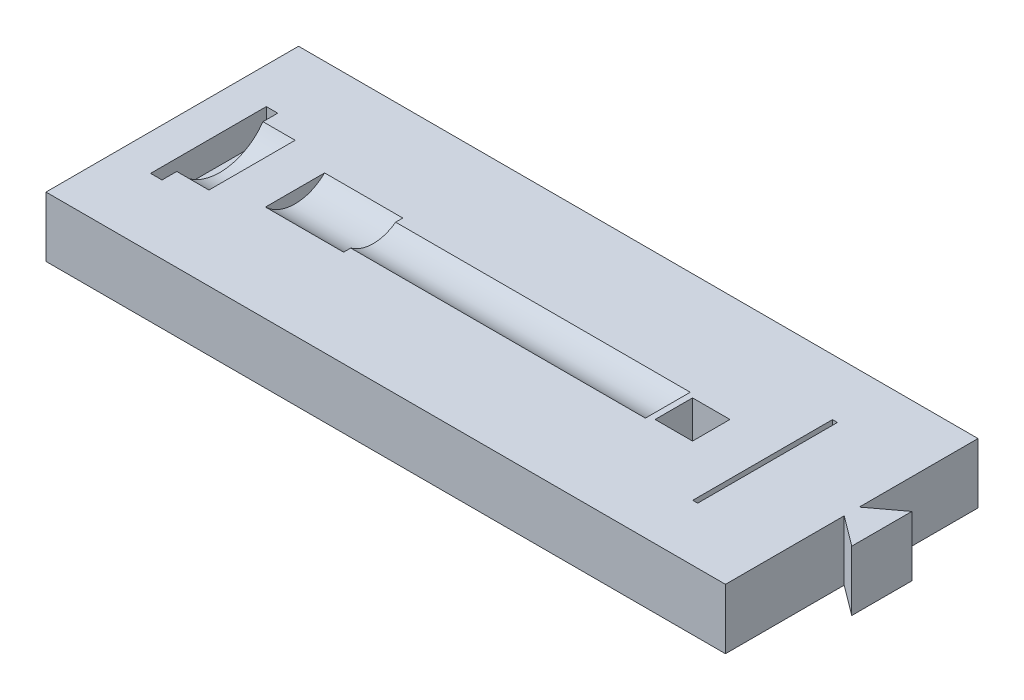
ISO-10303-21;
HEADER;
FILE_DESCRIPTION(('STEP AP214'),'2;1');
FILE_NAME('part.step','',(''),(''),'','','');
FILE_SCHEMA(('AUTOMOTIVE_DESIGN { 1 0 10303 214 1 1 1 1 }'));
ENDSEC;
DATA;
#1=APPLICATION_CONTEXT('core data for automotive mechanical design processes');
#2=APPLICATION_PROTOCOL_DEFINITION('international standard','automotive_design',2000,#1);
#3=PRODUCT_CONTEXT('',#1,'mechanical');
#4=PRODUCT('Part','Part','',(#3));
#5=PRODUCT_RELATED_PRODUCT_CATEGORY('part','',(#4));
#6=PRODUCT_DEFINITION_FORMATION('','',#4);
#7=PRODUCT_DEFINITION_CONTEXT('part definition',#1,'design');
#8=PRODUCT_DEFINITION('design','',#6,#7);
#9=PRODUCT_DEFINITION_SHAPE('','',#8);
#10=(LENGTH_UNIT() NAMED_UNIT(*) SI_UNIT(.MILLI.,.METRE.));
#11=(NAMED_UNIT(*) PLANE_ANGLE_UNIT() SI_UNIT($,.RADIAN.));
#12=(NAMED_UNIT(*) SI_UNIT($,.STERADIAN.) SOLID_ANGLE_UNIT());
#13=UNCERTAINTY_MEASURE_WITH_UNIT(LENGTH_MEASURE(1.E-05),#10,'distance_accuracy_value','');
#14=(GEOMETRIC_REPRESENTATION_CONTEXT(3) GLOBAL_UNCERTAINTY_ASSIGNED_CONTEXT((#13)) GLOBAL_UNIT_ASSIGNED_CONTEXT((#10,
#11,#12)) REPRESENTATION_CONTEXT('',''));
#15=CARTESIAN_POINT('',(0.,0.,0.));
#16=DIRECTION('',(0.,0.,1.));
#17=DIRECTION('',(1.,0.,0.));
#18=AXIS2_PLACEMENT_3D('',#15,#16,#17);
#19=CARTESIAN_POINT('',(0.,20.,0.));
#20=DIRECTION('',(0.,-1.,0.));
#21=DIRECTION('',(0.,0.,-1.));
#22=AXIS2_PLACEMENT_3D('',#19,#20,#21);
#23=PLANE('',#22);
#24=DIRECTION('',(1.,0.,0.));
#25=VECTOR('',#24,1.);
#26=CARTESIAN_POINT('',(1.1194790104737E-11,20.,1399.05037758246));
#27=LINE('',#26,#25);
#28=CARTESIAN_POINT('',(387.890531323274,20.,1399.05037758246));
#29=VERTEX_POINT('',#28);
#30=CARTESIAN_POINT('',(391.690531323274,20.,1399.05037758246));
#31=VERTEX_POINT('',#30);
#32=EDGE_CURVE('E269',#29,#31,#27,.T.);
#33=ORIENTED_EDGE('',*,*,#32,.F.);
#34=DIRECTION('',(0.,0.,-1.));
#35=VECTOR('',#34,1.);
#36=CARTESIAN_POINT('',(387.890531323263,20.,-3.10378607526632E-12));
#37=LINE('',#36,#35);
#38=CARTESIAN_POINT('',(387.890531323274,20.,1360.55037758246));
#39=VERTEX_POINT('',#38);
#40=EDGE_CURVE('E400',#29,#39,#37,.T.);
#41=ORIENTED_EDGE('',*,*,#40,.T.);
#42=DIRECTION('',(-1.,0.,0.));
#43=VECTOR('',#42,1.);
#44=CARTESIAN_POINT('',(1.08867244153677E-11,20.,1360.55037758246));
#45=LINE('',#44,#43);
#46=CARTESIAN_POINT('',(391.690531323274,20.,1360.55037758246));
#47=VERTEX_POINT('',#46);
#48=EDGE_CURVE('E276',#47,#39,#45,.T.);
#49=ORIENTED_EDGE('',*,*,#48,.F.);
#50=DIRECTION('',(0.,0.,-1.));
#51=VECTOR('',#50,1.);
#52=CARTESIAN_POINT('',(391.690531323263,20.,-3.13419255888369E-12));
#53=LINE('',#52,#51);
#54=CARTESIAN_POINT('',(391.690531323274,20.0000000000001,1365.46154430539));
#55=VERTEX_POINT('',#54);
#56=EDGE_CURVE('E264',#55,#47,#53,.T.);
#57=ORIENTED_EDGE('',*,*,#56,.F.);
#58=DIRECTION('',(-1.,0.,0.));
#59=VECTOR('',#58,1.);
#60=CARTESIAN_POINT('',(402.390531323274,20.,1365.46154430539));
#61=LINE('',#60,#59);
#62=CARTESIAN_POINT('',(402.390531323274,20.,1365.46154430539));
#63=VERTEX_POINT('',#62);
#64=EDGE_CURVE('E259',#63,#55,#61,.T.);
#65=ORIENTED_EDGE('',*,*,#64,.F.);
#66=DIRECTION('',(0.,0.,1.));
#67=VECTOR('',#66,1.);
#68=CARTESIAN_POINT('',(402.390531323263,20.,-3.21981081538522E-12));
#69=LINE('',#68,#67);
#70=CARTESIAN_POINT('',(402.390531323274,20.,1394.13921088));
#71=VERTEX_POINT('',#70);
#72=EDGE_CURVE('E360',#63,#71,#69,.T.);
#73=ORIENTED_EDGE('',*,*,#72,.T.);
#74=DIRECTION('',(-1.,0.,0.));
#75=VECTOR('',#74,1.);
#76=CARTESIAN_POINT('',(402.390531323274,20.,1394.13921088));
#77=LINE('',#76,#75);
#78=CARTESIAN_POINT('',(391.690531323274,19.9999999999999,1394.13921088));
#79=VERTEX_POINT('',#78);
#80=EDGE_CURVE('E260',#79,#71,#77,.F.);
#81=ORIENTED_EDGE('',*,*,#80,.F.);
#82=EDGE_CURVE('E265',#31,#79,#53,.T.);
#83=ORIENTED_EDGE('',*,*,#82,.F.);
#84=EDGE_LOOP('',(#33,#41,#49,#57,#65,#73,#81,#83));
#85=FACE_BOUND('',#84,.T.);
#86=DIRECTION('',(1.,0.,0.));
#87=VECTOR('',#86,1.);
#88=CARTESIAN_POINT('',(375.872687737076,20.,1421.81408512789));
#89=LINE('',#88,#87);
#90=CARTESIAN_POINT('',(375.872687737076,20.,1421.81408512789));
#91=VERTEX_POINT('',#90);
#92=CARTESIAN_POINT('',(601.872687737076,20.,1421.81408512789));
#93=VERTEX_POINT('',#92);
#94=EDGE_CURVE('E356',#91,#93,#89,.T.);
#95=ORIENTED_EDGE('',*,*,#94,.T.);
#96=DIRECTION('',(0.,0.,1.));
#97=VECTOR('',#96,1.);
#98=CARTESIAN_POINT('',(601.872687737076,20.,1337.81408512789));
#99=LINE('',#98,#97);
#100=CARTESIAN_POINT('',(601.872687737076,20.,1382.31408512789));
#101=VERTEX_POINT('',#100);
#102=EDGE_CURVE('E364',#101,#93,#99,.T.);
#103=ORIENTED_EDGE('',*,*,#102,.F.);
#104=DIRECTION('',(-0.799999999999998,0.,-0.600000000000003));
#105=VECTOR('',#104,1.);
#106=CARTESIAN_POINT('',(601.872687737076,20.,1382.31408512789));
#107=LINE('',#106,#105);
#108=CARTESIAN_POINT('',(611.872687737076,20.,1389.81408512789));
#109=VERTEX_POINT('',#108);
#110=EDGE_CURVE('E327',#109,#101,#107,.T.);
#111=ORIENTED_EDGE('',*,*,#110,.F.);
#112=DIRECTION('',(0.,0.,1.));
#113=VECTOR('',#112,1.);
#114=CARTESIAN_POINT('',(611.872687737076,20.,1389.81408512789));
#115=LINE('',#114,#113);
#116=CARTESIAN_POINT('',(611.872687737076,20.,1369.81408512789));
#117=VERTEX_POINT('',#116);
#118=EDGE_CURVE('E335',#117,#109,#115,.T.);
#119=ORIENTED_EDGE('',*,*,#118,.F.);
#120=DIRECTION('',(0.799999999999998,0.,-0.600000000000003));
#121=VECTOR('',#120,1.);
#122=CARTESIAN_POINT('',(601.872687737076,20.,1377.31408512789));
#123=LINE('',#122,#121);
#124=CARTESIAN_POINT('',(601.872687737076,20.,1377.31408512789));
#125=VERTEX_POINT('',#124);
#126=EDGE_CURVE('E331',#125,#117,#123,.T.);
#127=ORIENTED_EDGE('',*,*,#126,.F.);
#128=CARTESIAN_POINT('',(601.872687737076,20.,1337.81408512789));
#129=VERTEX_POINT('',#128);
#130=EDGE_CURVE('E354',#129,#125,#99,.T.);
#131=ORIENTED_EDGE('',*,*,#130,.F.);
#132=DIRECTION('',(1.,0.,0.));
#133=VECTOR('',#132,1.);
#134=CARTESIAN_POINT('',(375.872687737076,20.,1337.81408512789));
#135=LINE('',#134,#133);
#136=CARTESIAN_POINT('',(375.872687737076,20.,1337.81408512789));
#137=VERTEX_POINT('',#136);
#138=EDGE_CURVE('E365',#137,#129,#135,.T.);
#139=ORIENTED_EDGE('',*,*,#138,.F.);
#140=DIRECTION('',(0.,0.,1.));
#141=VECTOR('',#140,1.);
#142=CARTESIAN_POINT('',(375.872687737076,20.,1337.81408512789));
#143=LINE('',#142,#141);
#144=EDGE_CURVE('E359',#137,#91,#143,.T.);
#145=ORIENTED_EDGE('',*,*,#144,.T.);
#146=EDGE_LOOP('',(#95,#103,#111,#119,#127,#131,#139,#145));
#147=FACE_BOUND('',#146,.T.);
#148=DIRECTION('',(1.,0.,0.));
#149=VECTOR('',#148,1.);
#150=CARTESIAN_POINT('',(573.872687737076,20.,1403.06408512789));
#151=LINE('',#150,#149);
#152=CARTESIAN_POINT('',(572.222687737075,20.,1403.06408512789));
#153=VERTEX_POINT('',#152);
#154=CARTESIAN_POINT('',(573.872687737076,20.,1403.06408512789));
#155=VERTEX_POINT('',#154);
#156=EDGE_CURVE('E311',#153,#155,#151,.T.);
#157=ORIENTED_EDGE('',*,*,#156,.F.);
#158=DIRECTION('',(0.,0.,1.));
#159=VECTOR('',#158,1.);
#160=CARTESIAN_POINT('',(572.222687737075,20.,1403.06408512789));
#161=LINE('',#160,#159);
#162=CARTESIAN_POINT('',(572.222687737075,20.,1356.56408512789));
#163=VERTEX_POINT('',#162);
#164=EDGE_CURVE('E307',#163,#153,#161,.T.);
#165=ORIENTED_EDGE('',*,*,#164,.F.);
#166=DIRECTION('',(-1.,0.,0.));
#167=VECTOR('',#166,1.);
#168=CARTESIAN_POINT('',(572.222687737075,20.,1356.56408512789));
#169=LINE('',#168,#167);
#170=CARTESIAN_POINT('',(573.872687737076,20.,1356.56408512789));
#171=VERTEX_POINT('',#170);
#172=EDGE_CURVE('E319',#171,#163,#169,.T.);
#173=ORIENTED_EDGE('',*,*,#172,.F.);
#174=DIRECTION('',(0.,0.,-1.));
#175=VECTOR('',#174,1.);
#176=CARTESIAN_POINT('',(573.872687737076,20.,1356.56408512789));
#177=LINE('',#176,#175);
#178=EDGE_CURVE('E315',#155,#171,#177,.T.);
#179=ORIENTED_EDGE('',*,*,#178,.F.);
#180=EDGE_LOOP('',(#157,#165,#173,#179));
#181=FACE_BOUND('',#180,.T.);
#182=DIRECTION('',(0.,0.,1.));
#183=VECTOR('',#182,1.);
#184=CARTESIAN_POINT('',(416.690531323263,20.,-3.33423521426109E-12));
#185=LINE('',#184,#183);
#186=CARTESIAN_POINT('',(416.690531323274,20.,1369.96398394253));
#187=VERTEX_POINT('',#186);
#188=CARTESIAN_POINT('',(416.690531323274,20.,1389.63677124286));
#189=VERTEX_POINT('',#188);
#190=EDGE_CURVE('E255',#187,#189,#185,.T.);
#191=ORIENTED_EDGE('',*,*,#190,.F.);
#192=DIRECTION('',(-1.,0.,0.));
#193=VECTOR('',#192,1.);
#194=CARTESIAN_POINT('',(442.690531323274,20.,1369.96398394253));
#195=LINE('',#194,#193);
#196=CARTESIAN_POINT('',(442.690531323274,20.,1369.96398394253));
#197=VERTEX_POINT('',#196);
#198=EDGE_CURVE('E250',#197,#187,#195,.T.);
#199=ORIENTED_EDGE('',*,*,#198,.F.);
#200=DIRECTION('',(0.,0.,1.));
#201=VECTOR('',#200,1.);
#202=CARTESIAN_POINT('',(442.690531323263,20.,-3.5422795758536E-12));
#203=LINE('',#202,#201);
#204=CARTESIAN_POINT('',(442.690531323274,20.0000000000002,1372.34369334023));
#205=VERTEX_POINT('',#204);
#206=EDGE_CURVE('E371',#197,#205,#203,.T.);
#207=ORIENTED_EDGE('',*,*,#206,.T.);
#208=DIRECTION('',(1.,0.,0.));
#209=VECTOR('',#208,1.);
#210=CARTESIAN_POINT('',(437.182212377021,20.,1372.34369334023));
#211=LINE('',#210,#209);
#212=CARTESIAN_POINT('',(540.682212377021,20.,1372.34369334022));
#213=VERTEX_POINT('',#212);
#214=EDGE_CURVE('E292',#213,#205,#211,.F.);
#215=ORIENTED_EDGE('',*,*,#214,.F.);
#216=DIRECTION('',(0.,0.,-1.));
#217=VECTOR('',#216,1.);
#218=CARTESIAN_POINT('',(540.682212377009,20.,-4.63641956568851E-12));
#219=LINE('',#218,#217);
#220=CARTESIAN_POINT('',(540.682212377021,20.,1387.25706184516));
#221=VERTEX_POINT('',#220);
#222=EDGE_CURVE('E306',#221,#213,#219,.T.);
#223=ORIENTED_EDGE('',*,*,#222,.F.);
#224=DIRECTION('',(1.,0.,0.));
#225=VECTOR('',#224,1.);
#226=CARTESIAN_POINT('',(437.182212377021,20.,1387.25706184516));
#227=LINE('',#226,#225);
#228=CARTESIAN_POINT('',(442.690531323274,19.9999999999998,1387.25706184516));
#229=VERTEX_POINT('',#228);
#230=EDGE_CURVE('E291',#229,#221,#227,.T.);
#231=ORIENTED_EDGE('',*,*,#230,.F.);
#232=CARTESIAN_POINT('',(442.690531323274,20.,1389.63677124286));
#233=VERTEX_POINT('',#232);
#234=EDGE_CURVE('E363',#229,#233,#203,.T.);
#235=ORIENTED_EDGE('',*,*,#234,.T.);
#236=DIRECTION('',(-1.,0.,0.));
#237=VECTOR('',#236,1.);
#238=CARTESIAN_POINT('',(442.690531323274,20.,1389.63677124286));
#239=LINE('',#238,#237);
#240=EDGE_CURVE('E251',#189,#233,#239,.F.);
#241=ORIENTED_EDGE('',*,*,#240,.F.);
#242=EDGE_LOOP('',(#191,#199,#207,#215,#223,#231,#235,#241));
#243=FACE_BOUND('',#242,.T.);
#244=DIRECTION('',(0.,0.,-1.));
#245=VECTOR('',#244,1.);
#246=CARTESIAN_POINT('',(555.132212377012,20.,0.));
#247=LINE('',#246,#245);
#248=CARTESIAN_POINT('',(555.132212377012,20.,1386.02537759268));
#249=VERTEX_POINT('',#248);
#250=CARTESIAN_POINT('',(555.132212377012,20.,1373.57537759268));
#251=VERTEX_POINT('',#250);
#252=EDGE_CURVE('E246',#249,#251,#247,.T.);
#253=ORIENTED_EDGE('',*,*,#252,.F.);
#254=DIRECTION('',(1.,0.,0.));
#255=VECTOR('',#254,1.);
#256=CARTESIAN_POINT('',(0.,20.,1386.02537759268));
#257=LINE('',#256,#255);
#258=CARTESIAN_POINT('',(542.682212377012,20.,1386.02537759268));
#259=VERTEX_POINT('',#258);
#260=EDGE_CURVE('E238',#259,#249,#257,.T.);
#261=ORIENTED_EDGE('',*,*,#260,.F.);
#262=DIRECTION('',(0.,0.,1.));
#263=VECTOR('',#262,1.);
#264=CARTESIAN_POINT('',(542.682212377012,20.,0.));
#265=LINE('',#264,#263);
#266=CARTESIAN_POINT('',(542.682212377012,20.,1373.57537759268));
#267=VERTEX_POINT('',#266);
#268=EDGE_CURVE('E226',#267,#259,#265,.T.);
#269=ORIENTED_EDGE('',*,*,#268,.F.);
#270=DIRECTION('',(-1.,0.,0.));
#271=VECTOR('',#270,1.);
#272=CARTESIAN_POINT('',(0.,20.,1373.57537759268));
#273=LINE('',#272,#271);
#274=EDGE_CURVE('E222',#251,#267,#273,.T.);
#275=ORIENTED_EDGE('',*,*,#274,.F.);
#276=EDGE_LOOP('',(#253,#261,#269,#275));
#277=FACE_BOUND('',#276,.T.);
#278=ADVANCED_FACE('F46',(#85,#147,#181,#243,#277),#23,.F.);
#279=CARTESIAN_POINT('',(601.872687737076,20.,1337.81408512789));
#280=DIRECTION('',(1.,0.,0.));
#281=DIRECTION('',(0.,0.,-1.));
#282=AXIS2_PLACEMENT_3D('',#279,#280,#281);
#283=PLANE('',#282);
#284=ORIENTED_EDGE('',*,*,#130,.T.);
#285=DIRECTION('',(0.,-1.,0.));
#286=VECTOR('',#285,1.);
#287=CARTESIAN_POINT('',(601.872687737076,20.,1377.31408512789));
#288=LINE('',#287,#286);
#289=CARTESIAN_POINT('',(601.872687737076,0.,1377.31408512789));
#290=VERTEX_POINT('',#289);
#291=EDGE_CURVE('E350',#125,#290,#288,.T.);
#292=ORIENTED_EDGE('',*,*,#291,.T.);
#293=DIRECTION('',(0.,0.,1.));
#294=VECTOR('',#293,1.);
#295=CARTESIAN_POINT('',(601.872687737076,0.,1337.81408512789));
#296=LINE('',#295,#294);
#297=CARTESIAN_POINT('',(601.872687737076,0.,1337.81408512789));
#298=VERTEX_POINT('',#297);
#299=EDGE_CURVE('E345',#298,#290,#296,.T.);
#300=ORIENTED_EDGE('',*,*,#299,.F.);
#301=DIRECTION('',(0.,-1.,0.));
#302=VECTOR('',#301,1.);
#303=CARTESIAN_POINT('',(601.872687737076,20.,1337.81408512789));
#304=LINE('',#303,#302);
#305=EDGE_CURVE('E368',#129,#298,#304,.T.);
#306=ORIENTED_EDGE('',*,*,#305,.F.);
#307=EDGE_LOOP('',(#284,#292,#300,#306));
#308=FACE_BOUND('',#307,.T.);
#309=ADVANCED_FACE('F426',(#308),#283,.T.);
#310=CARTESIAN_POINT('',(375.872687737076,20.,1421.81408512789));
#311=DIRECTION('',(0.,0.,-1.));
#312=DIRECTION('',(-1.,0.,0.));
#313=AXIS2_PLACEMENT_3D('',#310,#311,#312);
#314=PLANE('',#313);
#315=DIRECTION('',(1.,0.,0.));
#316=VECTOR('',#315,1.);
#317=CARTESIAN_POINT('',(375.872687737076,0.,1421.81408512789));
#318=LINE('',#317,#316);
#319=CARTESIAN_POINT('',(375.872687737076,0.,1421.81408512789));
#320=VERTEX_POINT('',#319);
#321=CARTESIAN_POINT('',(601.872687737076,0.,1421.81408512789));
#322=VERTEX_POINT('',#321);
#323=EDGE_CURVE('E353',#320,#322,#318,.T.);
#324=ORIENTED_EDGE('',*,*,#323,.T.);
#325=DIRECTION('',(0.,-1.,0.));
#326=VECTOR('',#325,1.);
#327=CARTESIAN_POINT('',(601.872687737076,20.,1421.81408512789));
#328=LINE('',#327,#326);
#329=EDGE_CURVE('E369',#93,#322,#328,.T.);
#330=ORIENTED_EDGE('',*,*,#329,.F.);
#331=ORIENTED_EDGE('',*,*,#94,.F.);
#332=DIRECTION('',(0.,-1.,0.));
#333=VECTOR('',#332,1.);
#334=CARTESIAN_POINT('',(375.872687737076,20.,1421.81408512789));
#335=LINE('',#334,#333);
#336=EDGE_CURVE('E374',#91,#320,#335,.T.);
#337=ORIENTED_EDGE('',*,*,#336,.T.);
#338=EDGE_LOOP('',(#324,#330,#331,#337));
#339=FACE_BOUND('',#338,.T.);
#340=ADVANCED_FACE('F431',(#339),#314,.F.);
#341=DIRECTION('',(0.,-1.,0.));
#342=VECTOR('',#341,1.);
#343=CARTESIAN_POINT('',(601.872687737076,20.,1382.31408512789));
#344=LINE('',#343,#342);
#345=CARTESIAN_POINT('',(601.872687737076,0.,1382.31408512789));
#346=VERTEX_POINT('',#345);
#347=EDGE_CURVE('E329',#101,#346,#344,.T.);
#348=ORIENTED_EDGE('',*,*,#347,.F.);
#349=ORIENTED_EDGE('',*,*,#102,.T.);
#350=ORIENTED_EDGE('',*,*,#329,.T.);
#351=EDGE_CURVE('E330',#346,#322,#296,.T.);
#352=ORIENTED_EDGE('',*,*,#351,.F.);
#353=EDGE_LOOP('',(#348,#349,#350,#352));
#354=FACE_BOUND('',#353,.T.);
#355=ADVANCED_FACE('F434',(#354),#283,.T.);
#356=CARTESIAN_POINT('',(375.872687737076,20.,1337.81408512789));
#357=DIRECTION('',(0.,0.,-1.));
#358=DIRECTION('',(-1.,0.,0.));
#359=AXIS2_PLACEMENT_3D('',#356,#357,#358);
#360=PLANE('',#359);
#361=DIRECTION('',(1.,0.,0.));
#362=VECTOR('',#361,1.);
#363=CARTESIAN_POINT('',(375.872687737076,0.,1337.81408512789));
#364=LINE('',#363,#362);
#365=CARTESIAN_POINT('',(375.872687737076,0.,1337.81408512789));
#366=VERTEX_POINT('',#365);
#367=EDGE_CURVE('E377',#366,#298,#364,.T.);
#368=ORIENTED_EDGE('',*,*,#367,.F.);
#369=DIRECTION('',(0.,-1.,0.));
#370=VECTOR('',#369,1.);
#371=CARTESIAN_POINT('',(375.872687737076,20.,1337.81408512789));
#372=LINE('',#371,#370);
#373=EDGE_CURVE('E380',#137,#366,#372,.T.);
#374=ORIENTED_EDGE('',*,*,#373,.F.);
#375=ORIENTED_EDGE('',*,*,#138,.T.);
#376=ORIENTED_EDGE('',*,*,#305,.T.);
#377=EDGE_LOOP('',(#368,#374,#375,#376));
#378=FACE_BOUND('',#377,.T.);
#379=ADVANCED_FACE('F686',(#378),#360,.T.);
#380=CARTESIAN_POINT('',(375.872687737076,20.,1337.81408512789));
#381=DIRECTION('',(1.,0.,0.));
#382=DIRECTION('',(0.,0.,-1.));
#383=AXIS2_PLACEMENT_3D('',#380,#381,#382);
#384=PLANE('',#383);
#385=DIRECTION('',(0.,0.,1.));
#386=VECTOR('',#385,1.);
#387=CARTESIAN_POINT('',(375.872687737076,0.,1337.81408512789));
#388=LINE('',#387,#386);
#389=EDGE_CURVE('E381',#366,#320,#388,.T.);
#390=ORIENTED_EDGE('',*,*,#389,.T.);
#391=ORIENTED_EDGE('',*,*,#336,.F.);
#392=ORIENTED_EDGE('',*,*,#144,.F.);
#393=ORIENTED_EDGE('',*,*,#373,.T.);
#394=EDGE_LOOP('',(#390,#391,#392,#393));
#395=FACE_BOUND('',#394,.T.);
#396=ADVANCED_FACE('F676',(#395),#384,.F.);
#397=CARTESIAN_POINT('',(0.,0.,0.));
#398=DIRECTION('',(0.,-1.,0.));
#399=DIRECTION('',(0.,0.,-1.));
#400=AXIS2_PLACEMENT_3D('',#397,#398,#399);
#401=PLANE('',#400);
#402=ORIENTED_EDGE('',*,*,#323,.F.);
#403=ORIENTED_EDGE('',*,*,#389,.F.);
#404=ORIENTED_EDGE('',*,*,#367,.T.);
#405=ORIENTED_EDGE('',*,*,#299,.T.);
#406=DIRECTION('',(0.799999999999998,0.,-0.600000000000003));
#407=VECTOR('',#406,1.);
#408=CARTESIAN_POINT('',(601.872687737076,0.,1377.31408512789));
#409=LINE('',#408,#407);
#410=CARTESIAN_POINT('',(611.872687737076,0.,1369.81408512789));
#411=VERTEX_POINT('',#410);
#412=EDGE_CURVE('E342',#290,#411,#409,.T.);
#413=ORIENTED_EDGE('',*,*,#412,.T.);
#414=DIRECTION('',(0.,0.,1.));
#415=VECTOR('',#414,1.);
#416=CARTESIAN_POINT('',(611.872687737076,0.,1389.81408512789));
#417=LINE('',#416,#415);
#418=CARTESIAN_POINT('',(611.872687737076,0.,1389.81408512789));
#419=VERTEX_POINT('',#418);
#420=EDGE_CURVE('E341',#411,#419,#417,.T.);
#421=ORIENTED_EDGE('',*,*,#420,.T.);
#422=DIRECTION('',(-0.799999999999998,0.,-0.600000000000003));
#423=VECTOR('',#422,1.);
#424=CARTESIAN_POINT('',(601.872687737076,0.,1382.31408512789));
#425=LINE('',#424,#423);
#426=EDGE_CURVE('E338',#419,#346,#425,.T.);
#427=ORIENTED_EDGE('',*,*,#426,.T.);
#428=ORIENTED_EDGE('',*,*,#351,.T.);
#429=EDGE_LOOP('',(#402,#403,#404,#405,#413,#421,#427,#428));
#430=FACE_BOUND('',#429,.T.);
#431=ADVANCED_FACE('F667',(#430),#401,.T.);
#432=CARTESIAN_POINT('',(601.872687737076,20.,1382.31408512789));
#433=DIRECTION('',(-0.600000000000003,0.,0.799999999999998));
#434=DIRECTION('',(0.799999999999998,0.,0.600000000000003));
#435=AXIS2_PLACEMENT_3D('',#432,#433,#434);
#436=PLANE('',#435);
#437=ORIENTED_EDGE('',*,*,#426,.F.);
#438=DIRECTION('',(0.,-1.,0.));
#439=VECTOR('',#438,1.);
#440=CARTESIAN_POINT('',(611.872687737076,20.,1389.81408512789));
#441=LINE('',#440,#439);
#442=EDGE_CURVE('E334',#109,#419,#441,.T.);
#443=ORIENTED_EDGE('',*,*,#442,.F.);
#444=ORIENTED_EDGE('',*,*,#110,.T.);
#445=ORIENTED_EDGE('',*,*,#347,.T.);
#446=EDGE_LOOP('',(#437,#443,#444,#445));
#447=FACE_BOUND('',#446,.T.);
#448=ADVANCED_FACE('F658',(#447),#436,.T.);
#449=CARTESIAN_POINT('',(611.872687737076,20.,1389.81408512789));
#450=DIRECTION('',(1.,0.,0.));
#451=DIRECTION('',(0.,0.,-1.));
#452=AXIS2_PLACEMENT_3D('',#449,#450,#451);
#453=PLANE('',#452);
#454=ORIENTED_EDGE('',*,*,#420,.F.);
#455=DIRECTION('',(0.,-1.,0.));
#456=VECTOR('',#455,1.);
#457=CARTESIAN_POINT('',(611.872687737076,20.,1369.81408512789));
#458=LINE('',#457,#456);
#459=EDGE_CURVE('E310',#117,#411,#458,.T.);
#460=ORIENTED_EDGE('',*,*,#459,.F.);
#461=ORIENTED_EDGE('',*,*,#118,.T.);
#462=ORIENTED_EDGE('',*,*,#442,.T.);
#463=EDGE_LOOP('',(#454,#460,#461,#462));
#464=FACE_BOUND('',#463,.T.);
#465=ADVANCED_FACE('F649',(#464),#453,.T.);
#466=CARTESIAN_POINT('',(601.872687737076,20.,1377.31408512789));
#467=DIRECTION('',(-0.600000000000003,0.,-0.799999999999998));
#468=DIRECTION('',(-0.799999999999998,0.,0.600000000000003));
#469=AXIS2_PLACEMENT_3D('',#466,#467,#468);
#470=PLANE('',#469);
#471=ORIENTED_EDGE('',*,*,#412,.F.);
#472=ORIENTED_EDGE('',*,*,#291,.F.);
#473=ORIENTED_EDGE('',*,*,#126,.T.);
#474=ORIENTED_EDGE('',*,*,#459,.T.);
#475=EDGE_LOOP('',(#471,#472,#473,#474));
#476=FACE_BOUND('',#475,.T.);
#477=ADVANCED_FACE('F640',(#476),#470,.T.);
#478=CARTESIAN_POINT('',(572.222687737075,15.,1403.06408512789));
#479=DIRECTION('',(-1.,0.,0.));
#480=DIRECTION('',(0.,0.,1.));
#481=AXIS2_PLACEMENT_3D('',#478,#479,#480);
#482=PLANE('',#481);
#483=ORIENTED_EDGE('',*,*,#164,.T.);
#484=DIRECTION('',(0.,1.,0.));
#485=VECTOR('',#484,1.);
#486=CARTESIAN_POINT('',(572.222687737075,15.,1403.06408512789));
#487=LINE('',#486,#485);
#488=CARTESIAN_POINT('',(572.222687737075,15.,1403.06408512789));
#489=VERTEX_POINT('',#488);
#490=EDGE_CURVE('E297',#489,#153,#487,.T.);
#491=ORIENTED_EDGE('',*,*,#490,.F.);
#492=DIRECTION('',(0.,0.,1.));
#493=VECTOR('',#492,1.);
#494=CARTESIAN_POINT('',(572.222687737075,15.,1403.06408512789));
#495=LINE('',#494,#493);
#496=CARTESIAN_POINT('',(572.222687737075,15.,1356.56408512789));
#497=VERTEX_POINT('',#496);
#498=EDGE_CURVE('E293',#497,#489,#495,.T.);
#499=ORIENTED_EDGE('',*,*,#498,.F.);
#500=DIRECTION('',(0.,1.,0.));
#501=VECTOR('',#500,1.);
#502=CARTESIAN_POINT('',(572.222687737075,15.,1356.56408512789));
#503=LINE('',#502,#501);
#504=EDGE_CURVE('E309',#497,#163,#503,.T.);
#505=ORIENTED_EDGE('',*,*,#504,.T.);
#506=EDGE_LOOP('',(#483,#491,#499,#505));
#507=FACE_BOUND('',#506,.T.);
#508=ADVANCED_FACE('F632',(#507),#482,.F.);
#509=CARTESIAN_POINT('',(572.222687737075,15.,1356.56408512789));
#510=DIRECTION('',(0.,0.,-1.));
#511=DIRECTION('',(-1.,0.,0.));
#512=AXIS2_PLACEMENT_3D('',#509,#510,#511);
#513=PLANE('',#512);
#514=ORIENTED_EDGE('',*,*,#172,.T.);
#515=ORIENTED_EDGE('',*,*,#504,.F.);
#516=DIRECTION('',(-1.,0.,0.));
#517=VECTOR('',#516,1.);
#518=CARTESIAN_POINT('',(572.222687737075,15.,1356.56408512789));
#519=LINE('',#518,#517);
#520=CARTESIAN_POINT('',(573.872687737076,15.,1356.56408512789));
#521=VERTEX_POINT('',#520);
#522=EDGE_CURVE('E303',#521,#497,#519,.T.);
#523=ORIENTED_EDGE('',*,*,#522,.F.);
#524=DIRECTION('',(0.,1.,0.));
#525=VECTOR('',#524,1.);
#526=CARTESIAN_POINT('',(573.872687737076,15.,1356.56408512789));
#527=LINE('',#526,#525);
#528=EDGE_CURVE('E318',#521,#171,#527,.T.);
#529=ORIENTED_EDGE('',*,*,#528,.T.);
#530=EDGE_LOOP('',(#514,#515,#523,#529));
#531=FACE_BOUND('',#530,.T.);
#532=ADVANCED_FACE('F485',(#531),#513,.F.);
#533=CARTESIAN_POINT('',(573.872687737076,15.,1356.56408512789));
#534=DIRECTION('',(1.,0.,0.));
#535=DIRECTION('',(0.,0.,-1.));
#536=AXIS2_PLACEMENT_3D('',#533,#534,#535);
#537=PLANE('',#536);
#538=ORIENTED_EDGE('',*,*,#178,.T.);
#539=ORIENTED_EDGE('',*,*,#528,.F.);
#540=DIRECTION('',(0.,0.,-1.));
#541=VECTOR('',#540,1.);
#542=CARTESIAN_POINT('',(573.872687737076,15.,1356.56408512789));
#543=LINE('',#542,#541);
#544=CARTESIAN_POINT('',(573.872687737076,15.,1403.06408512789));
#545=VERTEX_POINT('',#544);
#546=EDGE_CURVE('E300',#545,#521,#543,.T.);
#547=ORIENTED_EDGE('',*,*,#546,.F.);
#548=DIRECTION('',(0.,1.,0.));
#549=VECTOR('',#548,1.);
#550=CARTESIAN_POINT('',(573.872687737076,15.,1403.06408512789));
#551=LINE('',#550,#549);
#552=EDGE_CURVE('E314',#545,#155,#551,.T.);
#553=ORIENTED_EDGE('',*,*,#552,.T.);
#554=EDGE_LOOP('',(#538,#539,#547,#553));
#555=FACE_BOUND('',#554,.T.);
#556=ADVANCED_FACE('F480',(#555),#537,.F.);
#557=CARTESIAN_POINT('',(573.872687737076,15.,1403.06408512789));
#558=DIRECTION('',(0.,0.,1.));
#559=DIRECTION('',(1.,0.,0.));
#560=AXIS2_PLACEMENT_3D('',#557,#558,#559);
#561=PLANE('',#560);
#562=ORIENTED_EDGE('',*,*,#156,.T.);
#563=ORIENTED_EDGE('',*,*,#552,.F.);
#564=DIRECTION('',(1.,0.,0.));
#565=VECTOR('',#564,1.);
#566=CARTESIAN_POINT('',(573.872687737076,15.,1403.06408512789));
#567=LINE('',#566,#565);
#568=EDGE_CURVE('E296',#489,#545,#567,.T.);
#569=ORIENTED_EDGE('',*,*,#568,.F.);
#570=ORIENTED_EDGE('',*,*,#490,.T.);
#571=EDGE_LOOP('',(#562,#563,#569,#570));
#572=FACE_BOUND('',#571,.T.);
#573=ADVANCED_FACE('F474',(#572),#561,.F.);
#574=CARTESIAN_POINT('',(0.,15.,0.));
#575=DIRECTION('',(0.,-1.,0.));
#576=DIRECTION('',(0.,0.,-1.));
#577=AXIS2_PLACEMENT_3D('',#574,#575,#576);
#578=PLANE('',#577);
#579=ORIENTED_EDGE('',*,*,#498,.T.);
#580=ORIENTED_EDGE('',*,*,#568,.T.);
#581=ORIENTED_EDGE('',*,*,#546,.T.);
#582=ORIENTED_EDGE('',*,*,#522,.T.);
#583=EDGE_LOOP('',(#579,#580,#581,#582));
#584=FACE_BOUND('',#583,.T.);
#585=ADVANCED_FACE('F468',(#584),#578,.F.);
#586=CARTESIAN_POINT('',(540.682212377021,30.0323407018991,1379.80037759269));
#587=DIRECTION('',(-1.,0.,0.));
#588=DIRECTION('',(0.,1.,1.02037095439655E-09));
#589=AXIS2_PLACEMENT_3D('',#586,#587,#588);
#590=PLANE('',#589);
#591=ORIENTED_EDGE('',*,*,#222,.T.);
#592=CARTESIAN_POINT('',(540.682212377021,30.0323407018991,1379.80037759269));
#593=DIRECTION('',(-1.,0.,0.));
#594=DIRECTION('',(0.,1.,1.02037095439655E-09));
#595=AXIS2_PLACEMENT_3D('',#592,#593,#594);
#596=CIRCLE('',#595,12.5);
#597=EDGE_CURVE('E49',#213,#221,#596,.T.);
#598=ORIENTED_EDGE('',*,*,#597,.T.);
#599=EDGE_LOOP('',(#591,#598));
#600=FACE_BOUND('',#599,.T.);
#601=ADVANCED_FACE('F466',(#600),#590,.T.);
#602=CARTESIAN_POINT('',(437.182212377021,30.0323407018989,1379.80037759269));
#603=DIRECTION('',(1.,0.,0.));
#604=DIRECTION('',(0.,-1.,-1.02037095439655E-09));
#605=AXIS2_PLACEMENT_3D('',#602,#603,#604);
#606=CYLINDRICAL_SURFACE('',#605,12.5);
#607=ORIENTED_EDGE('',*,*,#214,.T.);
#608=CARTESIAN_POINT('',(442.690531323274,30.0323407018989,1379.80037759269));
#609=DIRECTION('',(1.,0.,0.));
#610=DIRECTION('',(0.,0.,-1.));
#611=AXIS2_PLACEMENT_3D('',#608,#609,#610);
#612=CIRCLE('',#611,12.5);
#613=EDGE_CURVE('E288',#205,#229,#612,.F.);
#614=ORIENTED_EDGE('',*,*,#613,.T.);
#615=ORIENTED_EDGE('',*,*,#230,.T.);
#616=ORIENTED_EDGE('',*,*,#597,.F.);
#617=EDGE_LOOP('',(#607,#614,#615,#616));
#618=FACE_BOUND('',#617,.T.);
#619=ADVANCED_FACE('F464',(#618),#606,.F.);
#620=CARTESIAN_POINT('',(442.690531323274,30.0323407018989,1379.80037759269));
#621=DIRECTION('',(1.,0.,0.));
#622=DIRECTION('',(0.,1.02038727467502E-09,-1.));
#623=AXIS2_PLACEMENT_3D('',#620,#621,#622);
#624=PLANE('',#623);
#625=CARTESIAN_POINT('',(442.690531323274,30.0323407018989,1379.80037759269));
#626=DIRECTION('',(1.,0.,0.));
#627=DIRECTION('',(0.,1.02038727467502E-09,-1.));
#628=AXIS2_PLACEMENT_3D('',#625,#626,#627);
#629=CIRCLE('',#628,14.05);
#630=EDGE_CURVE('E247',#233,#197,#629,.T.);
#631=ORIENTED_EDGE('',*,*,#630,.F.);
#632=ORIENTED_EDGE('',*,*,#234,.F.);
#633=ORIENTED_EDGE('',*,*,#613,.F.);
#634=ORIENTED_EDGE('',*,*,#206,.F.);
#635=EDGE_LOOP('',(#631,#632,#633,#634));
#636=FACE_BOUND('',#635,.T.);
#637=ADVANCED_FACE('F457',(#636),#624,.F.);
#638=CARTESIAN_POINT('',(416.690531323274,30.0323407018988,1379.80037759269));
#639=DIRECTION('',(1.,0.,0.));
#640=DIRECTION('',(0.,1.02038727467502E-09,-1.));
#641=AXIS2_PLACEMENT_3D('',#638,#639,#640);
#642=PLANE('',#641);
#643=ORIENTED_EDGE('',*,*,#190,.T.);
#644=CARTESIAN_POINT('',(416.690531323274,30.0323407018988,1379.80037759269));
#645=DIRECTION('',(1.,0.,0.));
#646=DIRECTION('',(0.,1.02038727467502E-09,-1.));
#647=AXIS2_PLACEMENT_3D('',#644,#645,#646);
#648=CIRCLE('',#647,14.05);
#649=EDGE_CURVE('E252',#189,#187,#648,.T.);
#650=ORIENTED_EDGE('',*,*,#649,.T.);
#651=EDGE_LOOP('',(#643,#650));
#652=FACE_BOUND('',#651,.T.);
#653=ADVANCED_FACE('F452',(#652),#642,.T.);
#654=CARTESIAN_POINT('',(442.690531323274,30.0323407018989,1379.80037759269));
#655=DIRECTION('',(-1.,0.,0.));
#656=DIRECTION('',(0.,-1.02038727467502E-09,1.));
#657=AXIS2_PLACEMENT_3D('',#654,#655,#656);
#658=CYLINDRICAL_SURFACE('',#657,14.05);
#659=ORIENTED_EDGE('',*,*,#240,.T.);
#660=ORIENTED_EDGE('',*,*,#630,.T.);
#661=ORIENTED_EDGE('',*,*,#198,.T.);
#662=ORIENTED_EDGE('',*,*,#649,.F.);
#663=EDGE_LOOP('',(#659,#660,#661,#662));
#664=FACE_BOUND('',#663,.T.);
#665=ADVANCED_FACE('F454',(#664),#658,.F.);
#666=CARTESIAN_POINT('',(391.690531323274,10.7823406822563,1399.05037757305));
#667=DIRECTION('',(0.,1.02038727467502E-09,-1.));
#668=DIRECTION('',(0.,1.,1.02038727467502E-09));
#669=AXIS2_PLACEMENT_3D('',#666,#667,#668);
#670=PLANE('',#669);
#671=ORIENTED_EDGE('',*,*,#32,.T.);
#672=DIRECTION('',(0.,-1.,-1.02038727467502E-09));
#673=VECTOR('',#672,1.);
#674=CARTESIAN_POINT('',(391.690531323274,10.7823406822563,1399.05037757305));
#675=LINE('',#674,#673);
#676=CARTESIAN_POINT('',(391.690531323274,10.7823406822563,1399.05037757305));
#677=VERTEX_POINT('',#676);
#678=EDGE_CURVE('E266',#31,#677,#675,.T.);
#679=ORIENTED_EDGE('',*,*,#678,.T.);
#680=DIRECTION('',(-1.,0.,0.));
#681=VECTOR('',#680,1.);
#682=CARTESIAN_POINT('',(391.690531323274,10.7823406822563,1399.05037757305));
#683=LINE('',#682,#681);
#684=CARTESIAN_POINT('',(387.890531323274,10.7823406822563,1399.05037757305));
#685=VERTEX_POINT('',#684);
#686=EDGE_CURVE('E268',#677,#685,#683,.T.);
#687=ORIENTED_EDGE('',*,*,#686,.T.);
#688=DIRECTION('',(0.,-1.,-1.02038727467502E-09));
#689=VECTOR('',#688,1.);
#690=CARTESIAN_POINT('',(387.890531323274,10.7823406822563,1399.05037757305));
#691=LINE('',#690,#689);
#692=EDGE_CURVE('E277',#29,#685,#691,.T.);
#693=ORIENTED_EDGE('',*,*,#692,.F.);
#694=EDGE_LOOP('',(#671,#679,#687,#693));
#695=FACE_BOUND('',#694,.T.);
#696=ADVANCED_FACE('F487',(#695),#670,.T.);
#697=CARTESIAN_POINT('',(391.690531323274,10.7823407215412,1360.55037757305));
#698=DIRECTION('',(0.,-1.02038727467502E-09,1.));
#699=DIRECTION('',(0.,-1.,-1.02038727467502E-09));
#700=AXIS2_PLACEMENT_3D('',#697,#698,#699);
#701=PLANE('',#700);
#702=ORIENTED_EDGE('',*,*,#48,.T.);
#703=DIRECTION('',(0.,1.,1.02038727467502E-09));
#704=VECTOR('',#703,1.);
#705=CARTESIAN_POINT('',(387.890531323274,10.7823407215412,1360.55037757305));
#706=LINE('',#705,#704);
#707=CARTESIAN_POINT('',(387.890531323274,10.7823407215412,1360.55037757305));
#708=VERTEX_POINT('',#707);
#709=EDGE_CURVE('E281',#708,#39,#706,.T.);
#710=ORIENTED_EDGE('',*,*,#709,.F.);
#711=DIRECTION('',(-1.,0.,0.));
#712=VECTOR('',#711,1.);
#713=CARTESIAN_POINT('',(391.690531323274,10.7823407215412,1360.55037757305));
#714=LINE('',#713,#712);
#715=CARTESIAN_POINT('',(391.690531323274,10.7823407215412,1360.55037757305));
#716=VERTEX_POINT('',#715);
#717=EDGE_CURVE('E272',#716,#708,#714,.T.);
#718=ORIENTED_EDGE('',*,*,#717,.F.);
#719=DIRECTION('',(0.,1.,1.02038727467502E-09));
#720=VECTOR('',#719,1.);
#721=CARTESIAN_POINT('',(391.690531323274,10.7823407215412,1360.55037757305));
#722=LINE('',#721,#720);
#723=EDGE_CURVE('E273',#716,#47,#722,.T.);
#724=ORIENTED_EDGE('',*,*,#723,.T.);
#725=EDGE_LOOP('',(#702,#710,#718,#724));
#726=FACE_BOUND('',#725,.T.);
#727=ADVANCED_FACE('F490',(#726),#701,.T.);
#728=CARTESIAN_POINT('',(391.690531323274,30.0323407018988,1379.8003775927));
#729=DIRECTION('',(-1.,0.,0.));
#730=DIRECTION('',(0.,-1.02038727467502E-09,1.));
#731=AXIS2_PLACEMENT_3D('',#728,#729,#730);
#732=PLANE('',#731);
#733=ORIENTED_EDGE('',*,*,#82,.T.);
#734=CARTESIAN_POINT('',(391.690531323274,30.0323407018988,1379.8003775927));
#735=DIRECTION('',(1.,0.,0.));
#736=DIRECTION('',(0.,1.02038727467502E-09,-1.));
#737=AXIS2_PLACEMENT_3D('',#734,#735,#736);
#738=CIRCLE('',#737,17.5);
#739=EDGE_CURVE('E261',#79,#55,#738,.T.);
#740=ORIENTED_EDGE('',*,*,#739,.T.);
#741=ORIENTED_EDGE('',*,*,#56,.T.);
#742=ORIENTED_EDGE('',*,*,#723,.F.);
#743=DIRECTION('',(0.,1.02038727467502E-09,-1.));
#744=VECTOR('',#743,1.);
#745=CARTESIAN_POINT('',(391.690531323274,10.7823407215412,1360.55037757305));
#746=LINE('',#745,#744);
#747=EDGE_CURVE('E270',#677,#716,#746,.T.);
#748=ORIENTED_EDGE('',*,*,#747,.F.);
#749=ORIENTED_EDGE('',*,*,#678,.F.);
#750=EDGE_LOOP('',(#733,#740,#741,#742,#748,#749));
#751=FACE_BOUND('',#750,.T.);
#752=ADVANCED_FACE('F499',(#751),#732,.T.);
#753=CARTESIAN_POINT('',(387.890531323274,30.0323407018988,1379.8003775927));
#754=DIRECTION('',(-1.,0.,0.));
#755=DIRECTION('',(0.,-1.02038727467502E-09,1.));
#756=AXIS2_PLACEMENT_3D('',#753,#754,#755);
#757=PLANE('',#756);
#758=ORIENTED_EDGE('',*,*,#692,.T.);
#759=DIRECTION('',(0.,1.02038727467502E-09,-1.));
#760=VECTOR('',#759,1.);
#761=CARTESIAN_POINT('',(387.890531323274,10.7823407215412,1360.55037757305));
#762=LINE('',#761,#760);
#763=EDGE_CURVE('E279',#685,#708,#762,.T.);
#764=ORIENTED_EDGE('',*,*,#763,.T.);
#765=ORIENTED_EDGE('',*,*,#709,.T.);
#766=ORIENTED_EDGE('',*,*,#40,.F.);
#767=EDGE_LOOP('',(#758,#764,#765,#766));
#768=FACE_BOUND('',#767,.T.);
#769=ADVANCED_FACE('F501',(#768),#757,.F.);
#770=CARTESIAN_POINT('',(402.390531323274,30.0323407018988,1379.80037759269));
#771=DIRECTION('',(-1.,0.,0.));
#772=DIRECTION('',(0.,-1.02038727467502E-09,1.));
#773=AXIS2_PLACEMENT_3D('',#770,#771,#772);
#774=CYLINDRICAL_SURFACE('',#773,17.5);
#775=ORIENTED_EDGE('',*,*,#80,.T.);
#776=CARTESIAN_POINT('',(402.390531323274,30.0323407018988,1379.80037759269));
#777=DIRECTION('',(1.,0.,0.));
#778=DIRECTION('',(0.,1.02038727467502E-09,-1.));
#779=AXIS2_PLACEMENT_3D('',#776,#777,#778);
#780=CIRCLE('',#779,17.5);
#781=EDGE_CURVE('E256',#71,#63,#780,.T.);
#782=ORIENTED_EDGE('',*,*,#781,.T.);
#783=ORIENTED_EDGE('',*,*,#64,.T.);
#784=ORIENTED_EDGE('',*,*,#739,.F.);
#785=EDGE_LOOP('',(#775,#782,#783,#784));
#786=FACE_BOUND('',#785,.T.);
#787=ADVANCED_FACE('F504',(#786),#774,.F.);
#788=CARTESIAN_POINT('',(402.390531323274,30.0323407018988,1379.80037759269));
#789=DIRECTION('',(1.,0.,0.));
#790=DIRECTION('',(0.,1.02038727467502E-09,-1.));
#791=AXIS2_PLACEMENT_3D('',#788,#789,#790);
#792=PLANE('',#791);
#793=ORIENTED_EDGE('',*,*,#781,.F.);
#794=ORIENTED_EDGE('',*,*,#72,.F.);
#795=EDGE_LOOP('',(#793,#794));
#796=FACE_BOUND('',#795,.T.);
#797=ADVANCED_FACE('F495',(#796),#792,.F.);
#798=CARTESIAN_POINT('',(391.690531323274,10.7823407215412,1360.55037757305));
#799=DIRECTION('',(0.,1.,1.02038727467502E-09));
#800=DIRECTION('',(0.,-1.02038727467502E-09,1.));
#801=AXIS2_PLACEMENT_3D('',#798,#799,#800);
#802=PLANE('',#801);
#803=ORIENTED_EDGE('',*,*,#763,.F.);
#804=ORIENTED_EDGE('',*,*,#686,.F.);
#805=ORIENTED_EDGE('',*,*,#747,.T.);
#806=ORIENTED_EDGE('',*,*,#717,.T.);
#807=EDGE_LOOP('',(#803,#804,#805,#806));
#808=FACE_BOUND('',#807,.T.);
#809=ADVANCED_FACE('F492',(#808),#802,.T.);
#810=CARTESIAN_POINT('',(555.132212377012,52.2323407019221,1386.02537759268));
#811=DIRECTION('',(-1.,0.,0.));
#812=DIRECTION('',(0.,0.,1.));
#813=AXIS2_PLACEMENT_3D('',#810,#811,#812);
#814=PLANE('',#813);
#815=ORIENTED_EDGE('',*,*,#252,.T.);
#816=DIRECTION('',(0.,-1.,0.));
#817=VECTOR('',#816,1.);
#818=CARTESIAN_POINT('',(555.132212377012,52.2323407019221,1373.57537759268));
#819=LINE('',#818,#817);
#820=CARTESIAN_POINT('',(555.132212377012,7.83234070192207,1373.57537759268));
#821=VERTEX_POINT('',#820);
#822=EDGE_CURVE('E243',#251,#821,#819,.T.);
#823=ORIENTED_EDGE('',*,*,#822,.T.);
#824=DIRECTION('',(0.,0.,-1.));
#825=VECTOR('',#824,1.);
#826=CARTESIAN_POINT('',(555.132212377012,7.83234070192207,1386.02537759268));
#827=LINE('',#826,#825);
#828=CARTESIAN_POINT('',(555.132212377012,7.83234070192207,1386.02537759268));
#829=VERTEX_POINT('',#828);
#830=EDGE_CURVE('E232',#829,#821,#827,.T.);
#831=ORIENTED_EDGE('',*,*,#830,.F.);
#832=DIRECTION('',(0.,-1.,0.));
#833=VECTOR('',#832,1.);
#834=CARTESIAN_POINT('',(555.132212377012,52.2323407019221,1386.02537759268));
#835=LINE('',#834,#833);
#836=EDGE_CURVE('E237',#249,#829,#835,.T.);
#837=ORIENTED_EDGE('',*,*,#836,.F.);
#838=EDGE_LOOP('',(#815,#823,#831,#837));
#839=FACE_BOUND('',#838,.T.);
#840=ADVANCED_FACE('F413',(#839),#814,.T.);
#841=CARTESIAN_POINT('',(542.682212377012,52.2323407019221,1373.57537759268));
#842=DIRECTION('',(0.,0.,1.));
#843=DIRECTION('',(1.,0.,0.));
#844=AXIS2_PLACEMENT_3D('',#841,#842,#843);
#845=PLANE('',#844);
#846=ORIENTED_EDGE('',*,*,#274,.T.);
#847=DIRECTION('',(0.,-1.,0.));
#848=VECTOR('',#847,1.);
#849=CARTESIAN_POINT('',(542.682212377012,52.2323407019221,1373.57537759268));
#850=LINE('',#849,#848);
#851=CARTESIAN_POINT('',(542.682212377012,7.83234070192207,1373.57537759268));
#852=VERTEX_POINT('',#851);
#853=EDGE_CURVE('E215',#267,#852,#850,.T.);
#854=ORIENTED_EDGE('',*,*,#853,.T.);
#855=DIRECTION('',(-1.,0.,0.));
#856=VECTOR('',#855,1.);
#857=CARTESIAN_POINT('',(542.682212377012,7.83234070192207,1373.57537759268));
#858=LINE('',#857,#856);
#859=EDGE_CURVE('E219',#821,#852,#858,.T.);
#860=ORIENTED_EDGE('',*,*,#859,.F.);
#861=ORIENTED_EDGE('',*,*,#822,.F.);
#862=EDGE_LOOP('',(#846,#854,#860,#861));
#863=FACE_BOUND('',#862,.T.);
#864=ADVANCED_FACE('F217',(#863),#845,.T.);
#865=CARTESIAN_POINT('',(542.682212377012,52.2323407019221,1386.02537759268));
#866=DIRECTION('',(1.,0.,0.));
#867=DIRECTION('',(0.,0.,-1.));
#868=AXIS2_PLACEMENT_3D('',#865,#866,#867);
#869=PLANE('',#868);
#870=ORIENTED_EDGE('',*,*,#268,.T.);
#871=DIRECTION('',(0.,-1.,0.));
#872=VECTOR('',#871,1.);
#873=CARTESIAN_POINT('',(542.682212377012,52.2323407019221,1386.02537759268));
#874=LINE('',#873,#872);
#875=CARTESIAN_POINT('',(542.682212377012,7.83234070192207,1386.02537759268));
#876=VERTEX_POINT('',#875);
#877=EDGE_CURVE('E64',#259,#876,#874,.T.);
#878=ORIENTED_EDGE('',*,*,#877,.T.);
#879=DIRECTION('',(0.,0.,1.));
#880=VECTOR('',#879,1.);
#881=CARTESIAN_POINT('',(542.682212377012,7.83234070192207,1386.02537759268));
#882=LINE('',#881,#880);
#883=EDGE_CURVE('E55',#852,#876,#882,.T.);
#884=ORIENTED_EDGE('',*,*,#883,.F.);
#885=ORIENTED_EDGE('',*,*,#853,.F.);
#886=EDGE_LOOP('',(#870,#878,#884,#885));
#887=FACE_BOUND('',#886,.T.);
#888=ADVANCED_FACE('F234',(#887),#869,.T.);
#889=CARTESIAN_POINT('',(542.682212377012,52.2323407019221,1386.02537759268));
#890=DIRECTION('',(0.,0.,-1.));
#891=DIRECTION('',(-1.,0.,0.));
#892=AXIS2_PLACEMENT_3D('',#889,#890,#891);
#893=PLANE('',#892);
#894=ORIENTED_EDGE('',*,*,#260,.T.);
#895=ORIENTED_EDGE('',*,*,#836,.T.);
#896=DIRECTION('',(1.,0.,0.));
#897=VECTOR('',#896,1.);
#898=CARTESIAN_POINT('',(542.682212377012,7.83234070192207,1386.02537759268));
#899=LINE('',#898,#897);
#900=EDGE_CURVE('E12',#876,#829,#899,.T.);
#901=ORIENTED_EDGE('',*,*,#900,.F.);
#902=ORIENTED_EDGE('',*,*,#877,.F.);
#903=EDGE_LOOP('',(#894,#895,#901,#902));
#904=FACE_BOUND('',#903,.T.);
#905=ADVANCED_FACE('F416',(#904),#893,.T.);
#906=CARTESIAN_POINT('',(548.907212377012,7.83234070192207,1379.80037759268));
#907=DIRECTION('',(0.,-1.,0.));
#908=DIRECTION('',(0.,0.,-1.));
#909=AXIS2_PLACEMENT_3D('',#906,#907,#908);
#910=PLANE('',#909);
#911=ORIENTED_EDGE('',*,*,#830,.T.);
#912=ORIENTED_EDGE('',*,*,#859,.T.);
#913=ORIENTED_EDGE('',*,*,#883,.T.);
#914=ORIENTED_EDGE('',*,*,#900,.T.);
#915=EDGE_LOOP('',(#911,#912,#913,#914));
#916=FACE_BOUND('',#915,.T.);
#917=ADVANCED_FACE('F230',(#916),#910,.F.);
#918=CLOSED_SHELL('',(#278,#309,#340,#355,#379,#396,#431,#448,#465,#477,#508,#532,#556,#573,
#585,#601,#619,#637,#653,#665,#696,#727,#752,#769,#787,#797,#809,#840,#864,#888,#905,#917));
#919=MANIFOLD_SOLID_BREP('B2',#918);
#920=ADVANCED_BREP_SHAPE_REPRESENTATION('',(#18,#919),#14);
#921=SHAPE_DEFINITION_REPRESENTATION(#9,#920);
ENDSEC;
END-ISO-10303-21;
